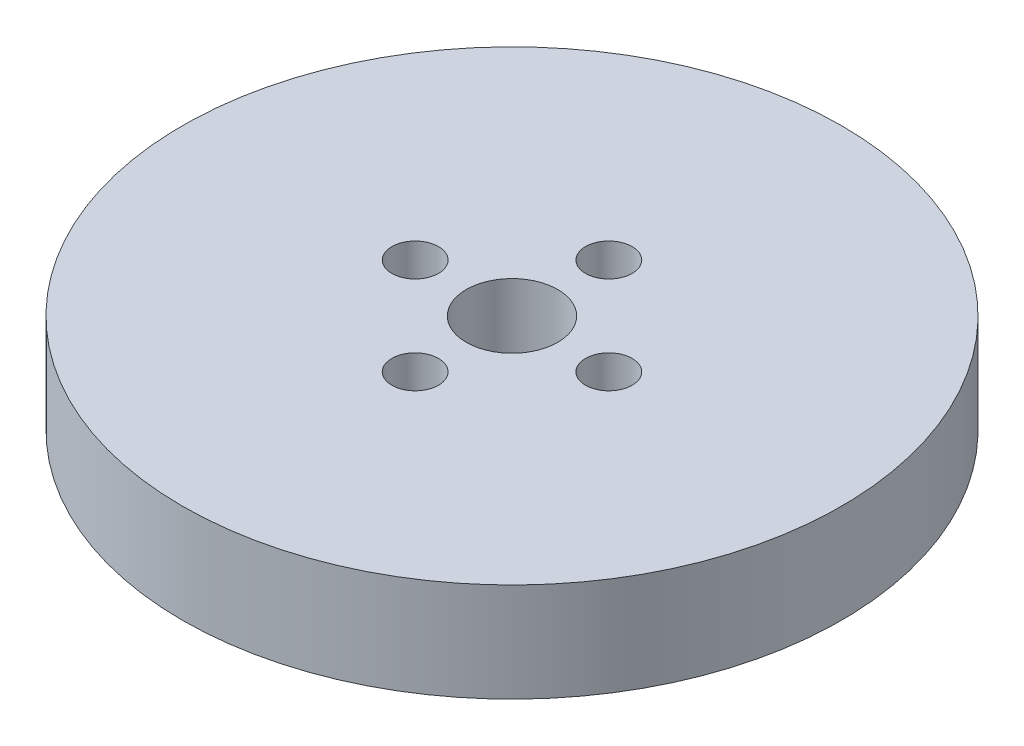
ISO-10303-21;
HEADER;
FILE_DESCRIPTION(('STEP AP214'),'2;1');
FILE_NAME('part.step','',(''),(''),'','','');
FILE_SCHEMA(('AUTOMOTIVE_DESIGN { 1 0 10303 214 1 1 1 1 }'));
ENDSEC;
DATA;
#1=APPLICATION_CONTEXT('core data for automotive mechanical design processes');
#2=APPLICATION_PROTOCOL_DEFINITION('international standard','automotive_design',2000,#1);
#3=PRODUCT_CONTEXT('',#1,'mechanical');
#4=PRODUCT('Part','Part','',(#3));
#5=PRODUCT_RELATED_PRODUCT_CATEGORY('part','',(#4));
#6=PRODUCT_DEFINITION_FORMATION('','',#4);
#7=PRODUCT_DEFINITION_CONTEXT('part definition',#1,'design');
#8=PRODUCT_DEFINITION('design','',#6,#7);
#9=PRODUCT_DEFINITION_SHAPE('','',#8);
#10=(LENGTH_UNIT() NAMED_UNIT(*) SI_UNIT(.MILLI.,.METRE.));
#11=(NAMED_UNIT(*) PLANE_ANGLE_UNIT() SI_UNIT($,.RADIAN.));
#12=(NAMED_UNIT(*) SI_UNIT($,.STERADIAN.) SOLID_ANGLE_UNIT());
#13=UNCERTAINTY_MEASURE_WITH_UNIT(LENGTH_MEASURE(1.E-05),#10,'distance_accuracy_value','');
#14=(GEOMETRIC_REPRESENTATION_CONTEXT(3) GLOBAL_UNCERTAINTY_ASSIGNED_CONTEXT((#13)) GLOBAL_UNIT_ASSIGNED_CONTEXT((#10,
#11,#12)) REPRESENTATION_CONTEXT('',''));
#15=CARTESIAN_POINT('',(0.,0.,0.));
#16=DIRECTION('',(0.,0.,1.));
#17=DIRECTION('',(1.,0.,0.));
#18=AXIS2_PLACEMENT_3D('',#15,#16,#17);
#19=CARTESIAN_POINT('',(0.,27.,0.));
#20=DIRECTION('',(0.,-1.,0.));
#21=DIRECTION('',(0.,0.,-1.));
#22=AXIS2_PLACEMENT_3D('',#19,#20,#21);
#23=CYLINDRICAL_SURFACE('',#22,90.);
#24=CARTESIAN_POINT('',(0.,27.,0.));
#25=DIRECTION('',(0.,1.,0.));
#26=DIRECTION('',(0.,0.,1.));
#27=AXIS2_PLACEMENT_3D('',#24,#25,#26);
#28=CIRCLE('',#27,90.);
#29=CARTESIAN_POINT('',(0.,27.,90.));
#30=VERTEX_POINT('',#29);
#31=EDGE_CURVE('E10',#30,#30,#28,.T.);
#32=ORIENTED_EDGE('',*,*,#31,.F.);
#33=EDGE_LOOP('',(#32));
#34=FACE_BOUND('',#33,.T.);
#35=CARTESIAN_POINT('',(0.,0.,0.));
#36=DIRECTION('',(0.,1.,0.));
#37=DIRECTION('',(0.,0.,1.));
#38=AXIS2_PLACEMENT_3D('',#35,#36,#37);
#39=CIRCLE('',#38,90.);
#40=CARTESIAN_POINT('',(0.,0.,90.));
#41=VERTEX_POINT('',#40);
#42=EDGE_CURVE('E37',#41,#41,#39,.T.);
#43=ORIENTED_EDGE('',*,*,#42,.T.);
#44=EDGE_LOOP('',(#43));
#45=FACE_BOUND('',#44,.T.);
#46=ADVANCED_FACE('F40',(#34,#45),#23,.T.);
#47=CARTESIAN_POINT('',(0.,27.,0.));
#48=DIRECTION('',(0.,1.,0.));
#49=DIRECTION('',(0.,0.,1.));
#50=AXIS2_PLACEMENT_3D('',#47,#48,#49);
#51=PLANE('',#50);
#52=CARTESIAN_POINT('',(0.,27.,26.4458564651901));
#53=DIRECTION('',(0.,1.,0.));
#54=DIRECTION('',(1.,0.,0.));
#55=AXIS2_PLACEMENT_3D('',#52,#53,#54);
#56=CIRCLE('',#55,6.36270686300948);
#57=CARTESIAN_POINT('',(6.36270686300957,27.,26.4458564651901));
#58=VERTEX_POINT('',#57);
#59=EDGE_CURVE('E71',#58,#58,#56,.T.);
#60=ORIENTED_EDGE('',*,*,#59,.F.);
#61=EDGE_LOOP('',(#60));
#62=FACE_BOUND('',#61,.T.);
#63=CARTESIAN_POINT('',(26.4458564651901,27.,0.));
#64=DIRECTION('',(0.,1.,0.));
#65=DIRECTION('',(0.,0.,-1.));
#66=AXIS2_PLACEMENT_3D('',#63,#64,#65);
#67=CIRCLE('',#66,6.36270686300948);
#68=CARTESIAN_POINT('',(26.4458564651901,27.,-6.36270686300948));
#69=VERTEX_POINT('',#68);
#70=EDGE_CURVE('E70',#69,#69,#67,.T.);
#71=ORIENTED_EDGE('',*,*,#70,.F.);
#72=EDGE_LOOP('',(#71));
#73=FACE_BOUND('',#72,.T.);
#74=CARTESIAN_POINT('',(-2.77005643013806E-13,27.,-26.4458564651901));
#75=DIRECTION('',(0.,1.,0.));
#76=DIRECTION('',(-1.,0.,0.));
#77=AXIS2_PLACEMENT_3D('',#74,#75,#76);
#78=CIRCLE('',#77,6.36270686300948);
#79=CARTESIAN_POINT('',(-6.36270686300976,27.,-26.4458564651901));
#80=VERTEX_POINT('',#79);
#81=EDGE_CURVE('E61',#80,#80,#78,.T.);
#82=ORIENTED_EDGE('',*,*,#81,.F.);
#83=EDGE_LOOP('',(#82));
#84=FACE_BOUND('',#83,.T.);
#85=CARTESIAN_POINT('',(-26.4458564651901,27.,0.));
#86=DIRECTION('',(0.,1.,0.));
#87=DIRECTION('',(0.,0.,1.));
#88=AXIS2_PLACEMENT_3D('',#85,#86,#87);
#89=CIRCLE('',#88,6.36270686300948);
#90=CARTESIAN_POINT('',(-26.4458564651901,27.,6.36270686300948));
#91=VERTEX_POINT('',#90);
#92=EDGE_CURVE('E54',#91,#91,#89,.T.);
#93=ORIENTED_EDGE('',*,*,#92,.F.);
#94=EDGE_LOOP('',(#93));
#95=FACE_BOUND('',#94,.T.);
#96=CARTESIAN_POINT('',(0.,27.,0.));
#97=DIRECTION('',(0.,1.,0.));
#98=DIRECTION('',(0.,0.,1.));
#99=AXIS2_PLACEMENT_3D('',#96,#97,#98);
#100=CIRCLE('',#99,12.5);
#101=CARTESIAN_POINT('',(0.,27.,12.5));
#102=VERTEX_POINT('',#101);
#103=EDGE_CURVE('E50',#102,#102,#100,.T.);
#104=ORIENTED_EDGE('',*,*,#103,.F.);
#105=EDGE_LOOP('',(#104));
#106=FACE_BOUND('',#105,.T.);
#107=ORIENTED_EDGE('',*,*,#31,.T.);
#108=EDGE_LOOP('',(#107));
#109=FACE_BOUND('',#108,.T.);
#110=ADVANCED_FACE('F86',(#62,#73,#84,#95,#106,#109),#51,.T.);
#111=CARTESIAN_POINT('',(0.,0.,0.));
#112=DIRECTION('',(0.,1.,0.));
#113=DIRECTION('',(0.,0.,1.));
#114=AXIS2_PLACEMENT_3D('',#111,#112,#113);
#115=PLANE('',#114);
#116=CARTESIAN_POINT('',(0.,0.,0.));
#117=DIRECTION('',(0.,1.,0.));
#118=DIRECTION('',(0.,0.,1.));
#119=AXIS2_PLACEMENT_3D('',#116,#117,#118);
#120=CIRCLE('',#119,12.5);
#121=CARTESIAN_POINT('',(0.,0.,12.5));
#122=VERTEX_POINT('',#121);
#123=EDGE_CURVE('E47',#122,#122,#120,.T.);
#124=ORIENTED_EDGE('',*,*,#123,.T.);
#125=EDGE_LOOP('',(#124));
#126=FACE_BOUND('',#125,.T.);
#127=ORIENTED_EDGE('',*,*,#42,.F.);
#128=EDGE_LOOP('',(#127));
#129=FACE_BOUND('',#128,.T.);
#130=ADVANCED_FACE('F93',(#126,#129),#115,.F.);
#131=CARTESIAN_POINT('',(0.,27.,0.));
#132=DIRECTION('',(0.,-1.,0.));
#133=DIRECTION('',(0.,0.,-1.));
#134=AXIS2_PLACEMENT_3D('',#131,#132,#133);
#135=CYLINDRICAL_SURFACE('',#134,12.5);
#136=ORIENTED_EDGE('',*,*,#103,.T.);
#137=EDGE_LOOP('',(#136));
#138=FACE_BOUND('',#137,.T.);
#139=ORIENTED_EDGE('',*,*,#123,.F.);
#140=EDGE_LOOP('',(#139));
#141=FACE_BOUND('',#140,.T.);
#142=ADVANCED_FACE('F101',(#138,#141),#135,.F.);
#143=CARTESIAN_POINT('',(-26.4458564651901,5.02114352605771,0.));
#144=DIRECTION('',(0.,1.,0.));
#145=DIRECTION('',(0.,0.,1.));
#146=AXIS2_PLACEMENT_3D('',#143,#144,#145);
#147=CYLINDRICAL_SURFACE('',#146,6.36270686300948);
#148=CARTESIAN_POINT('',(-26.4458564651901,5.02114352605771,0.));
#149=DIRECTION('',(0.,1.,0.));
#150=DIRECTION('',(0.,0.,1.));
#151=AXIS2_PLACEMENT_3D('',#148,#149,#150);
#152=CIRCLE('',#151,6.36270686300948);
#153=CARTESIAN_POINT('',(-26.4458564651901,5.02114352605771,6.36270686300948));
#154=VERTEX_POINT('',#153);
#155=EDGE_CURVE('E55',#154,#154,#152,.T.);
#156=ORIENTED_EDGE('',*,*,#155,.F.);
#157=EDGE_LOOP('',(#156));
#158=FACE_BOUND('',#157,.T.);
#159=ORIENTED_EDGE('',*,*,#92,.T.);
#160=EDGE_LOOP('',(#159));
#161=FACE_BOUND('',#160,.T.);
#162=ADVANCED_FACE('F102',(#158,#161),#147,.F.);
#163=CARTESIAN_POINT('',(-26.4458564651901,5.02114352605771,0.));
#164=DIRECTION('',(0.,1.,0.));
#165=DIRECTION('',(0.,0.,1.));
#166=AXIS2_PLACEMENT_3D('',#163,#164,#165);
#167=PLANE('',#166);
#168=ORIENTED_EDGE('',*,*,#155,.T.);
#169=EDGE_LOOP('',(#168));
#170=FACE_BOUND('',#169,.T.);
#171=ADVANCED_FACE('F133',(#170),#167,.T.);
#172=CARTESIAN_POINT('',(-2.77005643013806E-13,5.02114352605771,-26.4458564651901));
#173=DIRECTION('',(0.,1.,0.));
#174=DIRECTION('',(0.,0.,1.));
#175=AXIS2_PLACEMENT_3D('',#172,#173,#174);
#176=CYLINDRICAL_SURFACE('',#175,6.36270686300948);
#177=CARTESIAN_POINT('',(-2.77005643013806E-13,5.02114352605771,-26.4458564651901));
#178=DIRECTION('',(0.,1.,0.));
#179=DIRECTION('',(-1.,0.,0.));
#180=AXIS2_PLACEMENT_3D('',#177,#178,#179);
#181=CIRCLE('',#180,6.36270686300948);
#182=CARTESIAN_POINT('',(-6.36270686300976,5.02114352605771,-26.4458564651901));
#183=VERTEX_POINT('',#182);
#184=EDGE_CURVE('E63',#183,#183,#181,.T.);
#185=ORIENTED_EDGE('',*,*,#184,.F.);
#186=EDGE_LOOP('',(#185));
#187=FACE_BOUND('',#186,.T.);
#188=ORIENTED_EDGE('',*,*,#81,.T.);
#189=EDGE_LOOP('',(#188));
#190=FACE_BOUND('',#189,.T.);
#191=ADVANCED_FACE('F142',(#187,#190),#176,.F.);
#192=CARTESIAN_POINT('',(-2.77005643013806E-13,5.02114352605771,-26.4458564651901));
#193=DIRECTION('',(0.,1.,0.));
#194=DIRECTION('',(-1.,0.,0.));
#195=AXIS2_PLACEMENT_3D('',#192,#193,#194);
#196=PLANE('',#195);
#197=ORIENTED_EDGE('',*,*,#184,.T.);
#198=EDGE_LOOP('',(#197));
#199=FACE_BOUND('',#198,.T.);
#200=ADVANCED_FACE('F156',(#199),#196,.T.);
#201=CARTESIAN_POINT('',(26.4458564651901,5.02114352605771,0.));
#202=DIRECTION('',(0.,1.,0.));
#203=DIRECTION('',(0.,0.,1.));
#204=AXIS2_PLACEMENT_3D('',#201,#202,#203);
#205=CYLINDRICAL_SURFACE('',#204,6.36270686300948);
#206=CARTESIAN_POINT('',(26.4458564651901,5.02114352605771,0.));
#207=DIRECTION('',(0.,1.,0.));
#208=DIRECTION('',(0.,0.,-1.));
#209=AXIS2_PLACEMENT_3D('',#206,#207,#208);
#210=CIRCLE('',#209,6.36270686300948);
#211=CARTESIAN_POINT('',(26.4458564651901,5.02114352605771,-6.36270686300948));
#212=VERTEX_POINT('',#211);
#213=EDGE_CURVE('E69',#212,#212,#210,.T.);
#214=ORIENTED_EDGE('',*,*,#213,.F.);
#215=EDGE_LOOP('',(#214));
#216=FACE_BOUND('',#215,.T.);
#217=ORIENTED_EDGE('',*,*,#70,.T.);
#218=EDGE_LOOP('',(#217));
#219=FACE_BOUND('',#218,.T.);
#220=ADVANCED_FACE('F164',(#216,#219),#205,.F.);
#221=CARTESIAN_POINT('',(26.4458564651901,5.02114352605771,0.));
#222=DIRECTION('',(0.,1.,0.));
#223=DIRECTION('',(0.,0.,-1.));
#224=AXIS2_PLACEMENT_3D('',#221,#222,#223);
#225=PLANE('',#224);
#226=ORIENTED_EDGE('',*,*,#213,.T.);
#227=EDGE_LOOP('',(#226));
#228=FACE_BOUND('',#227,.T.);
#229=ADVANCED_FACE('F83',(#228),#225,.T.);
#230=CARTESIAN_POINT('',(0.,5.02114352605771,26.4458564651901));
#231=DIRECTION('',(0.,1.,0.));
#232=DIRECTION('',(0.,0.,1.));
#233=AXIS2_PLACEMENT_3D('',#230,#231,#232);
#234=CYLINDRICAL_SURFACE('',#233,6.36270686300948);
#235=CARTESIAN_POINT('',(0.,5.02114352605771,26.4458564651901));
#236=DIRECTION('',(0.,1.,0.));
#237=DIRECTION('',(1.,0.,0.));
#238=AXIS2_PLACEMENT_3D('',#235,#236,#237);
#239=CIRCLE('',#238,6.36270686300948);
#240=CARTESIAN_POINT('',(6.36270686300957,5.02114352605771,26.4458564651901));
#241=VERTEX_POINT('',#240);
#242=EDGE_CURVE('E59',#241,#241,#239,.T.);
#243=ORIENTED_EDGE('',*,*,#242,.F.);
#244=EDGE_LOOP('',(#243));
#245=FACE_BOUND('',#244,.T.);
#246=ORIENTED_EDGE('',*,*,#59,.T.);
#247=EDGE_LOOP('',(#246));
#248=FACE_BOUND('',#247,.T.);
#249=ADVANCED_FACE('F81',(#245,#248),#234,.F.);
#250=CARTESIAN_POINT('',(0.,5.02114352605771,26.4458564651901));
#251=DIRECTION('',(0.,1.,0.));
#252=DIRECTION('',(1.,0.,0.));
#253=AXIS2_PLACEMENT_3D('',#250,#251,#252);
#254=PLANE('',#253);
#255=ORIENTED_EDGE('',*,*,#242,.T.);
#256=EDGE_LOOP('',(#255));
#257=FACE_BOUND('',#256,.T.);
#258=ADVANCED_FACE('F78',(#257),#254,.T.);
#259=CLOSED_SHELL('',(#46,#110,#130,#142,#162,#171,#191,#200,#220,#229,#249,#258));
#260=MANIFOLD_SOLID_BREP('B2',#259);
#261=ADVANCED_BREP_SHAPE_REPRESENTATION('',(#18,#260),#14);
#262=SHAPE_DEFINITION_REPRESENTATION(#9,#261);
ENDSEC;
END-ISO-10303-21;
